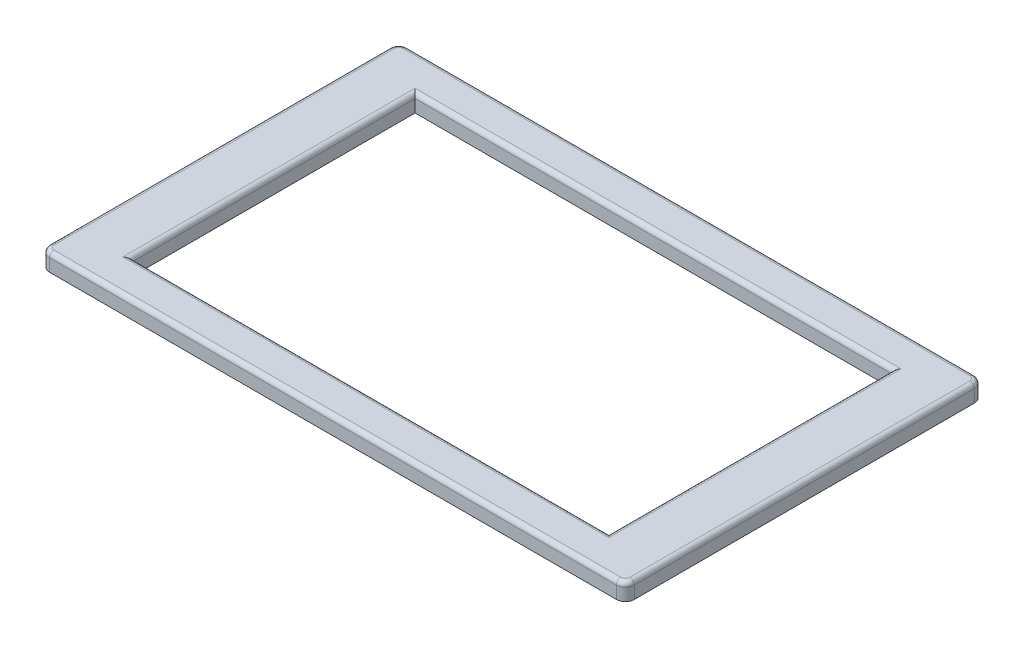
ISO-10303-21;
HEADER;
FILE_DESCRIPTION(('STEP AP214'),'2;1');
FILE_NAME('part.step','',(''),(''),'','','');
FILE_SCHEMA(('AUTOMOTIVE_DESIGN { 1 0 10303 214 1 1 1 1 }'));
ENDSEC;
DATA;
#1=APPLICATION_CONTEXT('core data for automotive mechanical design processes');
#2=APPLICATION_PROTOCOL_DEFINITION('international standard','automotive_design',2000,#1);
#3=PRODUCT_CONTEXT('',#1,'mechanical');
#4=PRODUCT('Part','Part','',(#3));
#5=PRODUCT_RELATED_PRODUCT_CATEGORY('part','',(#4));
#6=PRODUCT_DEFINITION_FORMATION('','',#4);
#7=PRODUCT_DEFINITION_CONTEXT('part definition',#1,'design');
#8=PRODUCT_DEFINITION('design','',#6,#7);
#9=PRODUCT_DEFINITION_SHAPE('','',#8);
#10=(LENGTH_UNIT() NAMED_UNIT(*) SI_UNIT(.MILLI.,.METRE.));
#11=(NAMED_UNIT(*) PLANE_ANGLE_UNIT() SI_UNIT($,.RADIAN.));
#12=(NAMED_UNIT(*) SI_UNIT($,.STERADIAN.) SOLID_ANGLE_UNIT());
#13=UNCERTAINTY_MEASURE_WITH_UNIT(LENGTH_MEASURE(1.E-05),#10,'distance_accuracy_value','');
#14=(GEOMETRIC_REPRESENTATION_CONTEXT(3) GLOBAL_UNCERTAINTY_ASSIGNED_CONTEXT((#13)) GLOBAL_UNIT_ASSIGNED_CONTEXT((#10,
#11,#12)) REPRESENTATION_CONTEXT('',''));
#15=CARTESIAN_POINT('',(0.,0.,0.));
#16=DIRECTION('',(0.,0.,1.));
#17=DIRECTION('',(1.,0.,0.));
#18=AXIS2_PLACEMENT_3D('',#15,#16,#17);
#19=CARTESIAN_POINT('',(4.00000000001397,5.7,-117.));
#20=DIRECTION('',(0.,-1.,0.));
#21=DIRECTION('',(0.,0.,-1.));
#22=AXIS2_PLACEMENT_3D('',#19,#20,#21);
#23=PLANE('',#22);
#24=DIRECTION('',(1.,0.,0.));
#25=VECTOR('',#24,1.);
#26=CARTESIAN_POINT('',(19.000000000014,5.7,-11.));
#27=LINE('',#26,#25);
#28=CARTESIAN_POINT('',(180.500000000014,5.7,-11.));
#29=VERTEX_POINT('',#28);
#30=CARTESIAN_POINT('',(17.500000000014,5.7,-11.));
#31=VERTEX_POINT('',#30);
#32=EDGE_CURVE('E266',#29,#31,#27,.F.);
#33=ORIENTED_EDGE('',*,*,#32,.T.);
#34=DIRECTION('',(0.,0.,1.));
#35=VECTOR('',#34,1.);
#36=CARTESIAN_POINT('',(17.500000000014,5.7,-107.5));
#37=LINE('',#36,#35);
#38=CARTESIAN_POINT('',(17.500000000014,5.7,-109.));
#39=VERTEX_POINT('',#38);
#40=EDGE_CURVE('E268',#31,#39,#37,.F.);
#41=ORIENTED_EDGE('',*,*,#40,.T.);
#42=DIRECTION('',(-1.,0.,0.));
#43=VECTOR('',#42,1.);
#44=CARTESIAN_POINT('',(179.000000000014,5.7,-109.));
#45=LINE('',#44,#43);
#46=CARTESIAN_POINT('',(180.500000000014,5.7,-109.));
#47=VERTEX_POINT('',#46);
#48=EDGE_CURVE('E262',#39,#47,#45,.F.);
#49=ORIENTED_EDGE('',*,*,#48,.T.);
#50=DIRECTION('',(0.,0.,-1.));
#51=VECTOR('',#50,1.);
#52=CARTESIAN_POINT('',(180.500000000014,5.7,-12.5));
#53=LINE('',#52,#51);
#54=EDGE_CURVE('E264',#47,#29,#53,.F.);
#55=ORIENTED_EDGE('',*,*,#54,.T.);
#56=EDGE_LOOP('',(#33,#41,#49,#55));
#57=FACE_BOUND('',#56,.T.);
#58=CARTESIAN_POINT('',(194.000000000014,5.7,-117.));
#59=DIRECTION('',(0.,-1.,0.));
#60=DIRECTION('',(0.,0.,-1.));
#61=AXIS2_PLACEMENT_3D('',#58,#59,#60);
#62=CIRCLE('',#61,1.49999999999998);
#63=CARTESIAN_POINT('',(195.500000000014,5.7,-117.));
#64=VERTEX_POINT('',#63);
#65=CARTESIAN_POINT('',(194.000000000014,5.7,-118.5));
#66=VERTEX_POINT('',#65);
#67=EDGE_CURVE('E257',#64,#66,#62,.F.);
#68=ORIENTED_EDGE('',*,*,#67,.T.);
#69=DIRECTION('',(-1.,0.,0.));
#70=VECTOR('',#69,1.);
#71=CARTESIAN_POINT('',(4.00000000001397,5.7,-118.5));
#72=LINE('',#71,#70);
#73=CARTESIAN_POINT('',(4.00000000001397,5.7,-118.5));
#74=VERTEX_POINT('',#73);
#75=EDGE_CURVE('E259',#66,#74,#72,.T.);
#76=ORIENTED_EDGE('',*,*,#75,.T.);
#77=CARTESIAN_POINT('',(4.00000000001397,5.7,-117.));
#78=DIRECTION('',(0.,-1.,0.));
#79=DIRECTION('',(0.,0.,-1.));
#80=AXIS2_PLACEMENT_3D('',#77,#78,#79);
#81=CIRCLE('',#80,1.5);
#82=CARTESIAN_POINT('',(2.50000000001397,5.7,-117.));
#83=VERTEX_POINT('',#82);
#84=EDGE_CURVE('E245',#74,#83,#81,.F.);
#85=ORIENTED_EDGE('',*,*,#84,.T.);
#86=DIRECTION('',(0.,0.,1.));
#87=VECTOR('',#86,1.);
#88=CARTESIAN_POINT('',(2.50000000001397,5.7,-117.));
#89=LINE('',#88,#87);
#90=CARTESIAN_POINT('',(2.50000000001397,5.7,-2.99999999999999));
#91=VERTEX_POINT('',#90);
#92=EDGE_CURVE('E247',#83,#91,#89,.T.);
#93=ORIENTED_EDGE('',*,*,#92,.T.);
#94=CARTESIAN_POINT('',(4.00000000001397,5.7,-2.99999999999998));
#95=DIRECTION('',(0.,-1.,0.));
#96=DIRECTION('',(0.,0.,-1.));
#97=AXIS2_PLACEMENT_3D('',#94,#95,#96);
#98=CIRCLE('',#97,1.5);
#99=CARTESIAN_POINT('',(4.00000000001395,5.7,-1.49999999999998));
#100=VERTEX_POINT('',#99);
#101=EDGE_CURVE('E249',#91,#100,#98,.F.);
#102=ORIENTED_EDGE('',*,*,#101,.T.);
#103=DIRECTION('',(1.,0.,0.));
#104=VECTOR('',#103,1.);
#105=CARTESIAN_POINT('',(4.00000000001397,5.7,-1.49999999999999));
#106=LINE('',#105,#104);
#107=CARTESIAN_POINT('',(194.000000000014,5.7,-1.49999999999999));
#108=VERTEX_POINT('',#107);
#109=EDGE_CURVE('E251',#100,#108,#106,.T.);
#110=ORIENTED_EDGE('',*,*,#109,.T.);
#111=CARTESIAN_POINT('',(194.000000000014,5.7,-2.99999999999998));
#112=DIRECTION('',(0.,-1.,0.));
#113=DIRECTION('',(0.,0.,-1.));
#114=AXIS2_PLACEMENT_3D('',#111,#112,#113);
#115=CIRCLE('',#114,1.5);
#116=CARTESIAN_POINT('',(195.500000000014,5.7,-2.99999999999998));
#117=VERTEX_POINT('',#116);
#118=EDGE_CURVE('E253',#108,#117,#115,.F.);
#119=ORIENTED_EDGE('',*,*,#118,.T.);
#120=DIRECTION('',(0.,0.,-1.));
#121=VECTOR('',#120,1.);
#122=CARTESIAN_POINT('',(195.500000000014,5.7,-117.));
#123=LINE('',#122,#121);
#124=EDGE_CURVE('E255',#117,#64,#123,.T.);
#125=ORIENTED_EDGE('',*,*,#124,.T.);
#126=EDGE_LOOP('',(#68,#76,#85,#93,#102,#110,#119,#125));
#127=FACE_BOUND('',#126,.T.);
#128=ADVANCED_FACE('F35',(#57,#127),#23,.F.);
#129=CARTESIAN_POINT('',(4.00000000001397,0.,-117.));
#130=DIRECTION('',(0.,-1.,0.));
#131=DIRECTION('',(0.,0.,-1.));
#132=AXIS2_PLACEMENT_3D('',#129,#130,#131);
#133=PLANE('',#132);
#134=CARTESIAN_POINT('',(193.000000000014,0.,-87.387683659692));
#135=DIRECTION('',(0.,-1.,0.));
#136=DIRECTION('',(0.,0.,-1.));
#137=AXIS2_PLACEMENT_3D('',#134,#135,#136);
#138=CIRCLE('',#137,2.);
#139=CARTESIAN_POINT('',(193.000000000014,0.,-89.387683659692));
#140=VERTEX_POINT('',#139);
#141=EDGE_CURVE('E490',#140,#140,#138,.T.);
#142=ORIENTED_EDGE('',*,*,#141,.F.);
#143=EDGE_LOOP('',(#142));
#144=FACE_BOUND('',#143,.T.);
#145=CARTESIAN_POINT('',(193.000000000014,0.,-27.387683659692));
#146=DIRECTION('',(0.,-1.,0.));
#147=DIRECTION('',(0.,0.,-1.));
#148=AXIS2_PLACEMENT_3D('',#145,#146,#147);
#149=CIRCLE('',#148,2.);
#150=CARTESIAN_POINT('',(193.000000000014,0.,-29.387683659692));
#151=VERTEX_POINT('',#150);
#152=EDGE_CURVE('E489',#151,#151,#149,.T.);
#153=ORIENTED_EDGE('',*,*,#152,.F.);
#154=EDGE_LOOP('',(#153));
#155=FACE_BOUND('',#154,.T.);
#156=CARTESIAN_POINT('',(5.00000000001397,0.,-87.387683659692));
#157=DIRECTION('',(0.,-1.,0.));
#158=DIRECTION('',(0.,0.,-1.));
#159=AXIS2_PLACEMENT_3D('',#156,#157,#158);
#160=CIRCLE('',#159,2.);
#161=CARTESIAN_POINT('',(5.00000000001397,0.,-89.387683659692));
#162=VERTEX_POINT('',#161);
#163=EDGE_CURVE('E499',#162,#162,#160,.T.);
#164=ORIENTED_EDGE('',*,*,#163,.F.);
#165=EDGE_LOOP('',(#164));
#166=FACE_BOUND('',#165,.T.);
#167=CARTESIAN_POINT('',(5.00000000001397,0.,-27.387683659692));
#168=DIRECTION('',(0.,-1.,0.));
#169=DIRECTION('',(0.,0.,-1.));
#170=AXIS2_PLACEMENT_3D('',#167,#168,#169);
#171=CIRCLE('',#170,2.);
#172=CARTESIAN_POINT('',(5.00000000001397,0.,-29.387683659692));
#173=VERTEX_POINT('',#172);
#174=EDGE_CURVE('E194',#173,#173,#171,.T.);
#175=ORIENTED_EDGE('',*,*,#174,.F.);
#176=EDGE_LOOP('',(#175));
#177=FACE_BOUND('',#176,.T.);
#178=CARTESIAN_POINT('',(4.00000000001397,0.,-117.));
#179=DIRECTION('',(0.,1.,0.));
#180=DIRECTION('',(0.,0.,-1.));
#181=AXIS2_PLACEMENT_3D('',#178,#179,#180);
#182=CIRCLE('',#181,3.);
#183=CARTESIAN_POINT('',(4.00000000001397,0.,-120.));
#184=VERTEX_POINT('',#183);
#185=CARTESIAN_POINT('',(1.00000000001397,0.,-117.));
#186=VERTEX_POINT('',#185);
#187=EDGE_CURVE('E173',#184,#186,#182,.T.);
#188=ORIENTED_EDGE('',*,*,#187,.F.);
#189=DIRECTION('',(-1.,0.,0.));
#190=VECTOR('',#189,1.);
#191=CARTESIAN_POINT('',(4.00000000001397,0.,-120.));
#192=LINE('',#191,#190);
#193=CARTESIAN_POINT('',(194.000000000014,0.,-120.));
#194=VERTEX_POINT('',#193);
#195=EDGE_CURVE('E224',#194,#184,#192,.T.);
#196=ORIENTED_EDGE('',*,*,#195,.F.);
#197=CARTESIAN_POINT('',(194.000000000014,0.,-117.));
#198=DIRECTION('',(0.,1.,0.));
#199=DIRECTION('',(0.,0.,1.));
#200=AXIS2_PLACEMENT_3D('',#197,#198,#199);
#201=CIRCLE('',#200,2.99999999999998);
#202=CARTESIAN_POINT('',(197.000000000014,0.,-117.));
#203=VERTEX_POINT('',#202);
#204=EDGE_CURVE('E221',#203,#194,#201,.T.);
#205=ORIENTED_EDGE('',*,*,#204,.F.);
#206=DIRECTION('',(0.,0.,-1.));
#207=VECTOR('',#206,1.);
#208=CARTESIAN_POINT('',(197.000000000014,0.,-2.99999999999998));
#209=LINE('',#208,#207);
#210=CARTESIAN_POINT('',(197.000000000014,0.,-2.99999999999998));
#211=VERTEX_POINT('',#210);
#212=EDGE_CURVE('E218',#211,#203,#209,.T.);
#213=ORIENTED_EDGE('',*,*,#212,.F.);
#214=CARTESIAN_POINT('',(194.000000000014,0.,-2.99999999999998));
#215=DIRECTION('',(0.,1.,0.));
#216=DIRECTION('',(0.,0.,-1.));
#217=AXIS2_PLACEMENT_3D('',#214,#215,#216);
#218=CIRCLE('',#217,3.);
#219=CARTESIAN_POINT('',(194.000000000014,0.,0.));
#220=VERTEX_POINT('',#219);
#221=EDGE_CURVE('E215',#220,#211,#218,.T.);
#222=ORIENTED_EDGE('',*,*,#221,.F.);
#223=DIRECTION('',(1.,0.,0.));
#224=VECTOR('',#223,1.);
#225=CARTESIAN_POINT('',(194.000000000014,0.,0.));
#226=LINE('',#225,#224);
#227=CARTESIAN_POINT('',(4.00000000001395,0.,0.));
#228=VERTEX_POINT('',#227);
#229=EDGE_CURVE('E212',#228,#220,#226,.T.);
#230=ORIENTED_EDGE('',*,*,#229,.F.);
#231=CARTESIAN_POINT('',(4.00000000001397,0.,-2.99999999999998));
#232=DIRECTION('',(0.,1.,0.));
#233=DIRECTION('',(0.,0.,1.));
#234=AXIS2_PLACEMENT_3D('',#231,#232,#233);
#235=CIRCLE('',#234,3.);
#236=CARTESIAN_POINT('',(1.00000000001397,0.,-3.));
#237=VERTEX_POINT('',#236);
#238=EDGE_CURVE('E209',#237,#228,#235,.T.);
#239=ORIENTED_EDGE('',*,*,#238,.F.);
#240=DIRECTION('',(0.,0.,1.));
#241=VECTOR('',#240,1.);
#242=CARTESIAN_POINT('',(1.00000000001397,0.,-3.));
#243=LINE('',#242,#241);
#244=EDGE_CURVE('E206',#186,#237,#243,.T.);
#245=ORIENTED_EDGE('',*,*,#244,.F.);
#246=EDGE_LOOP('',(#188,#196,#205,#213,#222,#230,#239,#245));
#247=FACE_BOUND('',#246,.T.);
#248=DIRECTION('',(0.,0.,-1.));
#249=VECTOR('',#248,1.);
#250=CARTESIAN_POINT('',(179.000000000014,0.,-107.5));
#251=LINE('',#250,#249);
#252=CARTESIAN_POINT('',(179.000000000014,0.,-12.5));
#253=VERTEX_POINT('',#252);
#254=CARTESIAN_POINT('',(179.000000000014,0.,-107.5));
#255=VERTEX_POINT('',#254);
#256=EDGE_CURVE('E187',#253,#255,#251,.T.);
#257=ORIENTED_EDGE('',*,*,#256,.T.);
#258=DIRECTION('',(-1.,0.,0.));
#259=VECTOR('',#258,1.);
#260=CARTESIAN_POINT('',(19.000000000014,0.,-107.5));
#261=LINE('',#260,#259);
#262=CARTESIAN_POINT('',(19.000000000014,0.,-107.5));
#263=VERTEX_POINT('',#262);
#264=EDGE_CURVE('E166',#255,#263,#261,.T.);
#265=ORIENTED_EDGE('',*,*,#264,.T.);
#266=DIRECTION('',(0.,0.,1.));
#267=VECTOR('',#266,1.);
#268=CARTESIAN_POINT('',(19.000000000014,0.,-12.5));
#269=LINE('',#268,#267);
#270=CARTESIAN_POINT('',(19.000000000014,0.,-12.5));
#271=VERTEX_POINT('',#270);
#272=EDGE_CURVE('E177',#263,#271,#269,.T.);
#273=ORIENTED_EDGE('',*,*,#272,.T.);
#274=DIRECTION('',(1.,0.,0.));
#275=VECTOR('',#274,1.);
#276=CARTESIAN_POINT('',(179.000000000014,0.,-12.5));
#277=LINE('',#276,#275);
#278=EDGE_CURVE('E183',#271,#253,#277,.T.);
#279=ORIENTED_EDGE('',*,*,#278,.T.);
#280=EDGE_LOOP('',(#257,#265,#273,#279));
#281=FACE_BOUND('',#280,.T.);
#282=ADVANCED_FACE('F185',(#144,#155,#166,#177,#247,#281),#133,.T.);
#283=CARTESIAN_POINT('',(4.00000000001397,5.7,-117.));
#284=DIRECTION('',(0.,-1.,0.));
#285=DIRECTION('',(0.,0.,-1.));
#286=AXIS2_PLACEMENT_3D('',#283,#284,#285);
#287=CYLINDRICAL_SURFACE('',#286,3.);
#288=DIRECTION('',(0.,-1.,0.));
#289=VECTOR('',#288,1.);
#290=CARTESIAN_POINT('',(1.00000000001397,5.7,-117.));
#291=LINE('',#290,#289);
#292=CARTESIAN_POINT('',(1.00000000001397,4.2,-117.));
#293=VERTEX_POINT('',#292);
#294=EDGE_CURVE('E241',#293,#186,#291,.T.);
#295=ORIENTED_EDGE('',*,*,#294,.F.);
#296=CARTESIAN_POINT('',(4.00000000001397,4.2,-117.));
#297=DIRECTION('',(0.,-1.,0.));
#298=DIRECTION('',(0.,0.,-1.));
#299=AXIS2_PLACEMENT_3D('',#296,#297,#298);
#300=CIRCLE('',#299,3.);
#301=CARTESIAN_POINT('',(4.00000000001397,4.2,-120.));
#302=VERTEX_POINT('',#301);
#303=EDGE_CURVE('E11',#293,#302,#300,.T.);
#304=ORIENTED_EDGE('',*,*,#303,.T.);
#305=DIRECTION('',(0.,-1.,0.));
#306=VECTOR('',#305,1.);
#307=CARTESIAN_POINT('',(4.00000000001397,5.7,-120.));
#308=LINE('',#307,#306);
#309=EDGE_CURVE('E227',#302,#184,#308,.T.);
#310=ORIENTED_EDGE('',*,*,#309,.T.);
#311=ORIENTED_EDGE('',*,*,#187,.T.);
#312=EDGE_LOOP('',(#295,#304,#310,#311));
#313=FACE_BOUND('',#312,.T.);
#314=ADVANCED_FACE('F369',(#313),#287,.T.);
#315=CARTESIAN_POINT('',(1.00000000001397,5.7,-3.));
#316=DIRECTION('',(1.,0.,0.));
#317=DIRECTION('',(0.,0.,-1.));
#318=AXIS2_PLACEMENT_3D('',#315,#316,#317);
#319=PLANE('',#318);
#320=DIRECTION('',(0.,-1.,0.));
#321=VECTOR('',#320,1.);
#322=CARTESIAN_POINT('',(1.00000000001397,5.7,-3.));
#323=LINE('',#322,#321);
#324=CARTESIAN_POINT('',(1.00000000001397,4.2,-3.));
#325=VERTEX_POINT('',#324);
#326=EDGE_CURVE('E239',#325,#237,#323,.T.);
#327=ORIENTED_EDGE('',*,*,#326,.F.);
#328=DIRECTION('',(0.,0.,1.));
#329=VECTOR('',#328,1.);
#330=CARTESIAN_POINT('',(1.00000000001397,4.2,-3.));
#331=LINE('',#330,#329);
#332=EDGE_CURVE('E44',#325,#293,#331,.F.);
#333=ORIENTED_EDGE('',*,*,#332,.T.);
#334=ORIENTED_EDGE('',*,*,#294,.T.);
#335=ORIENTED_EDGE('',*,*,#244,.T.);
#336=EDGE_LOOP('',(#327,#333,#334,#335));
#337=FACE_BOUND('',#336,.T.);
#338=ADVANCED_FACE('F414',(#337),#319,.F.);
#339=CARTESIAN_POINT('',(4.00000000001397,5.7,-2.99999999999998));
#340=DIRECTION('',(0.,-1.,0.));
#341=DIRECTION('',(0.,0.,-1.));
#342=AXIS2_PLACEMENT_3D('',#339,#340,#341);
#343=CYLINDRICAL_SURFACE('',#342,3.);
#344=DIRECTION('',(0.,-1.,0.));
#345=VECTOR('',#344,1.);
#346=CARTESIAN_POINT('',(4.00000000001395,5.7,0.));
#347=LINE('',#346,#345);
#348=CARTESIAN_POINT('',(4.00000000001395,4.2,0.));
#349=VERTEX_POINT('',#348);
#350=EDGE_CURVE('E237',#349,#228,#347,.T.);
#351=ORIENTED_EDGE('',*,*,#350,.F.);
#352=CARTESIAN_POINT('',(4.00000000001397,4.2,-2.99999999999998));
#353=DIRECTION('',(0.,-1.,0.));
#354=DIRECTION('',(0.,0.,-1.));
#355=AXIS2_PLACEMENT_3D('',#352,#353,#354);
#356=CIRCLE('',#355,3.);
#357=EDGE_CURVE('E59',#349,#325,#356,.T.);
#358=ORIENTED_EDGE('',*,*,#357,.T.);
#359=ORIENTED_EDGE('',*,*,#326,.T.);
#360=ORIENTED_EDGE('',*,*,#238,.T.);
#361=EDGE_LOOP('',(#351,#358,#359,#360));
#362=FACE_BOUND('',#361,.T.);
#363=ADVANCED_FACE('F329',(#362),#343,.T.);
#364=CARTESIAN_POINT('',(194.000000000014,5.7,0.));
#365=DIRECTION('',(0.,0.,-1.));
#366=DIRECTION('',(-1.,0.,0.));
#367=AXIS2_PLACEMENT_3D('',#364,#365,#366);
#368=PLANE('',#367);
#369=DIRECTION('',(0.,-1.,0.));
#370=VECTOR('',#369,1.);
#371=CARTESIAN_POINT('',(194.000000000014,5.7,0.));
#372=LINE('',#371,#370);
#373=CARTESIAN_POINT('',(194.000000000014,4.2,0.));
#374=VERTEX_POINT('',#373);
#375=EDGE_CURVE('E235',#374,#220,#372,.T.);
#376=ORIENTED_EDGE('',*,*,#375,.F.);
#377=DIRECTION('',(1.,0.,0.));
#378=VECTOR('',#377,1.);
#379=CARTESIAN_POINT('',(194.000000000014,4.2,0.));
#380=LINE('',#379,#378);
#381=EDGE_CURVE('E285',#374,#349,#380,.F.);
#382=ORIENTED_EDGE('',*,*,#381,.T.);
#383=ORIENTED_EDGE('',*,*,#350,.T.);
#384=ORIENTED_EDGE('',*,*,#229,.T.);
#385=EDGE_LOOP('',(#376,#382,#383,#384));
#386=FACE_BOUND('',#385,.T.);
#387=ADVANCED_FACE('F328',(#386),#368,.F.);
#388=CARTESIAN_POINT('',(194.000000000014,5.7,-2.99999999999998));
#389=DIRECTION('',(0.,-1.,0.));
#390=DIRECTION('',(0.,0.,-1.));
#391=AXIS2_PLACEMENT_3D('',#388,#389,#390);
#392=CYLINDRICAL_SURFACE('',#391,3.);
#393=DIRECTION('',(0.,-1.,0.));
#394=VECTOR('',#393,1.);
#395=CARTESIAN_POINT('',(197.000000000014,5.7,-2.99999999999998));
#396=LINE('',#395,#394);
#397=CARTESIAN_POINT('',(197.000000000014,4.2,-2.99999999999998));
#398=VERTEX_POINT('',#397);
#399=EDGE_CURVE('E233',#398,#211,#396,.T.);
#400=ORIENTED_EDGE('',*,*,#399,.F.);
#401=CARTESIAN_POINT('',(194.000000000014,4.2,-2.99999999999998));
#402=DIRECTION('',(0.,-1.,0.));
#403=DIRECTION('',(0.,0.,-1.));
#404=AXIS2_PLACEMENT_3D('',#401,#402,#403);
#405=CIRCLE('',#404,3.);
#406=EDGE_CURVE('E283',#398,#374,#405,.T.);
#407=ORIENTED_EDGE('',*,*,#406,.T.);
#408=ORIENTED_EDGE('',*,*,#375,.T.);
#409=ORIENTED_EDGE('',*,*,#221,.T.);
#410=EDGE_LOOP('',(#400,#407,#408,#409));
#411=FACE_BOUND('',#410,.T.);
#412=ADVANCED_FACE('F340',(#411),#392,.T.);
#413=CARTESIAN_POINT('',(197.000000000014,5.7,-2.99999999999998));
#414=DIRECTION('',(-1.,0.,0.));
#415=DIRECTION('',(0.,0.,1.));
#416=AXIS2_PLACEMENT_3D('',#413,#414,#415);
#417=PLANE('',#416);
#418=DIRECTION('',(0.,-1.,0.));
#419=VECTOR('',#418,1.);
#420=CARTESIAN_POINT('',(197.000000000014,5.7,-117.));
#421=LINE('',#420,#419);
#422=CARTESIAN_POINT('',(197.000000000014,4.2,-117.));
#423=VERTEX_POINT('',#422);
#424=EDGE_CURVE('E231',#423,#203,#421,.T.);
#425=ORIENTED_EDGE('',*,*,#424,.F.);
#426=DIRECTION('',(0.,0.,-1.));
#427=VECTOR('',#426,1.);
#428=CARTESIAN_POINT('',(197.000000000014,4.2,-2.99999999999998));
#429=LINE('',#428,#427);
#430=EDGE_CURVE('E281',#423,#398,#429,.F.);
#431=ORIENTED_EDGE('',*,*,#430,.T.);
#432=ORIENTED_EDGE('',*,*,#399,.T.);
#433=ORIENTED_EDGE('',*,*,#212,.T.);
#434=EDGE_LOOP('',(#425,#431,#432,#433));
#435=FACE_BOUND('',#434,.T.);
#436=ADVANCED_FACE('F343',(#435),#417,.F.);
#437=CARTESIAN_POINT('',(194.000000000014,5.7,-117.));
#438=DIRECTION('',(0.,-1.,0.));
#439=DIRECTION('',(0.,0.,-1.));
#440=AXIS2_PLACEMENT_3D('',#437,#438,#439);
#441=CYLINDRICAL_SURFACE('',#440,2.99999999999998);
#442=DIRECTION('',(0.,-1.,0.));
#443=VECTOR('',#442,1.);
#444=CARTESIAN_POINT('',(194.000000000014,5.7,-120.));
#445=LINE('',#444,#443);
#446=CARTESIAN_POINT('',(194.000000000014,4.2,-120.));
#447=VERTEX_POINT('',#446);
#448=EDGE_CURVE('E229',#447,#194,#445,.T.);
#449=ORIENTED_EDGE('',*,*,#448,.F.);
#450=CARTESIAN_POINT('',(194.000000000014,4.2,-117.));
#451=DIRECTION('',(0.,-1.,0.));
#452=DIRECTION('',(0.,0.,-1.));
#453=AXIS2_PLACEMENT_3D('',#450,#451,#452);
#454=CIRCLE('',#453,2.99999999999998);
#455=EDGE_CURVE('E279',#447,#423,#454,.T.);
#456=ORIENTED_EDGE('',*,*,#455,.T.);
#457=ORIENTED_EDGE('',*,*,#424,.T.);
#458=ORIENTED_EDGE('',*,*,#204,.T.);
#459=EDGE_LOOP('',(#449,#456,#457,#458));
#460=FACE_BOUND('',#459,.T.);
#461=ADVANCED_FACE('F402',(#460),#441,.T.);
#462=CARTESIAN_POINT('',(4.00000000001397,5.7,-120.));
#463=DIRECTION('',(0.,0.,1.));
#464=DIRECTION('',(1.,0.,0.));
#465=AXIS2_PLACEMENT_3D('',#462,#463,#464);
#466=PLANE('',#465);
#467=ORIENTED_EDGE('',*,*,#309,.F.);
#468=DIRECTION('',(-1.,0.,0.));
#469=VECTOR('',#468,1.);
#470=CARTESIAN_POINT('',(4.00000000001397,4.2,-120.));
#471=LINE('',#470,#469);
#472=EDGE_CURVE('E276',#302,#447,#471,.F.);
#473=ORIENTED_EDGE('',*,*,#472,.T.);
#474=ORIENTED_EDGE('',*,*,#448,.T.);
#475=ORIENTED_EDGE('',*,*,#195,.T.);
#476=EDGE_LOOP('',(#467,#473,#474,#475));
#477=FACE_BOUND('',#476,.T.);
#478=ADVANCED_FACE('F372',(#477),#466,.F.);
#479=CARTESIAN_POINT('',(19.000000000014,5.7,-107.5));
#480=DIRECTION('',(0.,0.,1.));
#481=DIRECTION('',(1.,0.,0.));
#482=AXIS2_PLACEMENT_3D('',#479,#480,#481);
#483=PLANE('',#482);
#484=DIRECTION('',(0.,-1.,0.));
#485=VECTOR('',#484,1.);
#486=CARTESIAN_POINT('',(179.000000000014,5.7,-107.5));
#487=LINE('',#486,#485);
#488=CARTESIAN_POINT('',(179.000000000014,4.2,-107.5));
#489=VERTEX_POINT('',#488);
#490=EDGE_CURVE('E199',#489,#255,#487,.T.);
#491=ORIENTED_EDGE('',*,*,#490,.F.);
#492=DIRECTION('',(-1.,0.,0.));
#493=VECTOR('',#492,1.);
#494=CARTESIAN_POINT('',(19.000000000014,4.2,-107.5));
#495=LINE('',#494,#493);
#496=CARTESIAN_POINT('',(19.000000000014,4.2,-107.5));
#497=VERTEX_POINT('',#496);
#498=EDGE_CURVE('E169',#489,#497,#495,.T.);
#499=ORIENTED_EDGE('',*,*,#498,.T.);
#500=DIRECTION('',(0.,-1.,0.));
#501=VECTOR('',#500,1.);
#502=CARTESIAN_POINT('',(19.000000000014,5.7,-107.5));
#503=LINE('',#502,#501);
#504=EDGE_CURVE('E161',#497,#263,#503,.T.);
#505=ORIENTED_EDGE('',*,*,#504,.T.);
#506=ORIENTED_EDGE('',*,*,#264,.F.);
#507=EDGE_LOOP('',(#491,#499,#505,#506));
#508=FACE_BOUND('',#507,.T.);
#509=ADVANCED_FACE('F164',(#508),#483,.T.);
#510=CARTESIAN_POINT('',(19.000000000014,5.7,-12.5));
#511=DIRECTION('',(1.,0.,0.));
#512=DIRECTION('',(0.,0.,-1.));
#513=AXIS2_PLACEMENT_3D('',#510,#511,#512);
#514=PLANE('',#513);
#515=ORIENTED_EDGE('',*,*,#504,.F.);
#516=DIRECTION('',(0.,0.,1.));
#517=VECTOR('',#516,1.);
#518=CARTESIAN_POINT('',(19.000000000014,4.2,-12.5));
#519=LINE('',#518,#517);
#520=CARTESIAN_POINT('',(19.000000000014,4.2,-12.5));
#521=VERTEX_POINT('',#520);
#522=EDGE_CURVE('E243',#497,#521,#519,.T.);
#523=ORIENTED_EDGE('',*,*,#522,.T.);
#524=DIRECTION('',(0.,-1.,0.));
#525=VECTOR('',#524,1.);
#526=CARTESIAN_POINT('',(19.000000000014,5.7,-12.5));
#527=LINE('',#526,#525);
#528=EDGE_CURVE('E174',#521,#271,#527,.T.);
#529=ORIENTED_EDGE('',*,*,#528,.T.);
#530=ORIENTED_EDGE('',*,*,#272,.F.);
#531=EDGE_LOOP('',(#515,#523,#529,#530));
#532=FACE_BOUND('',#531,.T.);
#533=ADVANCED_FACE('F178',(#532),#514,.T.);
#534=CARTESIAN_POINT('',(179.000000000014,5.7,-12.5));
#535=DIRECTION('',(0.,0.,-1.));
#536=DIRECTION('',(-1.,0.,0.));
#537=AXIS2_PLACEMENT_3D('',#534,#535,#536);
#538=PLANE('',#537);
#539=ORIENTED_EDGE('',*,*,#528,.F.);
#540=DIRECTION('',(1.,0.,0.));
#541=VECTOR('',#540,1.);
#542=CARTESIAN_POINT('',(179.000000000014,4.2,-12.5));
#543=LINE('',#542,#541);
#544=CARTESIAN_POINT('',(179.000000000014,4.2,-12.5));
#545=VERTEX_POINT('',#544);
#546=EDGE_CURVE('E271',#521,#545,#543,.T.);
#547=ORIENTED_EDGE('',*,*,#546,.T.);
#548=DIRECTION('',(0.,-1.,0.));
#549=VECTOR('',#548,1.);
#550=CARTESIAN_POINT('',(179.000000000014,5.7,-12.5));
#551=LINE('',#550,#549);
#552=EDGE_CURVE('E201',#545,#253,#551,.T.);
#553=ORIENTED_EDGE('',*,*,#552,.T.);
#554=ORIENTED_EDGE('',*,*,#278,.F.);
#555=EDGE_LOOP('',(#539,#547,#553,#554));
#556=FACE_BOUND('',#555,.T.);
#557=ADVANCED_FACE('F437',(#556),#538,.T.);
#558=CARTESIAN_POINT('',(179.000000000014,5.7,-107.5));
#559=DIRECTION('',(-1.,0.,0.));
#560=DIRECTION('',(0.,0.,1.));
#561=AXIS2_PLACEMENT_3D('',#558,#559,#560);
#562=PLANE('',#561);
#563=ORIENTED_EDGE('',*,*,#552,.F.);
#564=DIRECTION('',(0.,0.,-1.));
#565=VECTOR('',#564,1.);
#566=CARTESIAN_POINT('',(179.000000000014,4.2,-107.5));
#567=LINE('',#566,#565);
#568=EDGE_CURVE('E273',#545,#489,#567,.T.);
#569=ORIENTED_EDGE('',*,*,#568,.T.);
#570=ORIENTED_EDGE('',*,*,#490,.T.);
#571=ORIENTED_EDGE('',*,*,#256,.F.);
#572=EDGE_LOOP('',(#563,#569,#570,#571));
#573=FACE_BOUND('',#572,.T.);
#574=ADVANCED_FACE('F432',(#573),#562,.T.);
#575=CARTESIAN_POINT('',(180.500000000014,4.2,-107.5));
#576=DIRECTION('',(0.,0.,1.));
#577=DIRECTION('',(1.,0.,0.));
#578=AXIS2_PLACEMENT_3D('',#575,#576,#577);
#579=CYLINDRICAL_SURFACE('',#578,1.5);
#580=CARTESIAN_POINT('',(180.500000000014,4.2,-11.));
#581=DIRECTION('',(-0.707106781186547,0.,0.707106781186548));
#582=DIRECTION('',(-0.707106781186548,0.,-0.707106781186547));
#583=AXIS2_PLACEMENT_3D('',#580,#581,#582);
#584=ELLIPSE('',#583,2.12132034355964,1.5);
#585=EDGE_CURVE('E191',#29,#545,#584,.T.);
#586=ORIENTED_EDGE('',*,*,#585,.F.);
#587=ORIENTED_EDGE('',*,*,#54,.F.);
#588=CARTESIAN_POINT('',(180.500000000014,4.2,-109.));
#589=DIRECTION('',(0.707106781186547,0.,0.707106781186547));
#590=DIRECTION('',(-0.707106781186547,0.,0.707106781186547));
#591=AXIS2_PLACEMENT_3D('',#588,#589,#590);
#592=ELLIPSE('',#591,2.12132034355964,1.5);
#593=EDGE_CURVE('E188',#489,#47,#592,.F.);
#594=ORIENTED_EDGE('',*,*,#593,.F.);
#595=ORIENTED_EDGE('',*,*,#568,.F.);
#596=EDGE_LOOP('',(#586,#587,#594,#595));
#597=FACE_BOUND('',#596,.T.);
#598=ADVANCED_FACE('F429',(#597),#579,.T.);
#599=CARTESIAN_POINT('',(19.000000000014,4.2,-109.));
#600=DIRECTION('',(1.,0.,0.));
#601=DIRECTION('',(0.,0.,-1.));
#602=AXIS2_PLACEMENT_3D('',#599,#600,#601);
#603=CYLINDRICAL_SURFACE('',#602,1.5);
#604=ORIENTED_EDGE('',*,*,#593,.T.);
#605=ORIENTED_EDGE('',*,*,#48,.F.);
#606=CARTESIAN_POINT('',(17.500000000014,4.2,-109.));
#607=DIRECTION('',(0.707106781186547,0.,-0.707106781186547));
#608=DIRECTION('',(-0.707106781186547,0.,-0.707106781186547));
#609=AXIS2_PLACEMENT_3D('',#606,#607,#608);
#610=ELLIPSE('',#609,2.12132034355964,1.5);
#611=EDGE_CURVE('E291',#497,#39,#610,.F.);
#612=ORIENTED_EDGE('',*,*,#611,.F.);
#613=ORIENTED_EDGE('',*,*,#498,.F.);
#614=EDGE_LOOP('',(#604,#605,#612,#613));
#615=FACE_BOUND('',#614,.T.);
#616=ADVANCED_FACE('F426',(#615),#603,.T.);
#617=CARTESIAN_POINT('',(179.000000000014,4.2,-11.));
#618=DIRECTION('',(-1.,0.,0.));
#619=DIRECTION('',(0.,0.,1.));
#620=AXIS2_PLACEMENT_3D('',#617,#618,#619);
#621=CYLINDRICAL_SURFACE('',#620,1.5);
#622=ORIENTED_EDGE('',*,*,#585,.T.);
#623=ORIENTED_EDGE('',*,*,#546,.F.);
#624=CARTESIAN_POINT('',(17.500000000014,4.2,-11.));
#625=DIRECTION('',(-0.707106781186548,0.,-0.707106781186547));
#626=DIRECTION('',(0.707106781186547,0.,-0.707106781186548));
#627=AXIS2_PLACEMENT_3D('',#624,#625,#626);
#628=ELLIPSE('',#627,2.12132034355964,1.5);
#629=EDGE_CURVE('E289',#31,#521,#628,.T.);
#630=ORIENTED_EDGE('',*,*,#629,.F.);
#631=ORIENTED_EDGE('',*,*,#32,.F.);
#632=EDGE_LOOP('',(#622,#623,#630,#631));
#633=FACE_BOUND('',#632,.T.);
#634=ADVANCED_FACE('F422',(#633),#621,.T.);
#635=CARTESIAN_POINT('',(17.500000000014,4.2,-12.5));
#636=DIRECTION('',(0.,0.,-1.));
#637=DIRECTION('',(-1.,0.,0.));
#638=AXIS2_PLACEMENT_3D('',#635,#636,#637);
#639=CYLINDRICAL_SURFACE('',#638,1.5);
#640=ORIENTED_EDGE('',*,*,#611,.T.);
#641=ORIENTED_EDGE('',*,*,#40,.F.);
#642=ORIENTED_EDGE('',*,*,#629,.T.);
#643=ORIENTED_EDGE('',*,*,#522,.F.);
#644=EDGE_LOOP('',(#640,#641,#642,#643));
#645=FACE_BOUND('',#644,.T.);
#646=ADVANCED_FACE('F419',(#645),#639,.T.);
#647=CARTESIAN_POINT('',(4.00000000001397,4.2,-1.49999999999999));
#648=DIRECTION('',(1.,0.,0.));
#649=DIRECTION('',(0.,0.,-1.));
#650=AXIS2_PLACEMENT_3D('',#647,#648,#649);
#651=CYLINDRICAL_SURFACE('',#650,1.5);
#652=CARTESIAN_POINT('',(4.00000000001395,4.2,-1.49999999999998));
#653=DIRECTION('',(-1.,0.,0.));
#654=DIRECTION('',(0.,0.,1.));
#655=AXIS2_PLACEMENT_3D('',#652,#653,#654);
#656=CIRCLE('',#655,1.5);
#657=EDGE_CURVE('E311',#349,#100,#656,.T.);
#658=ORIENTED_EDGE('',*,*,#657,.F.);
#659=ORIENTED_EDGE('',*,*,#381,.F.);
#660=CARTESIAN_POINT('',(194.000000000014,4.2,-1.49999999999999));
#661=DIRECTION('',(1.,0.,0.));
#662=DIRECTION('',(0.,0.,-1.));
#663=AXIS2_PLACEMENT_3D('',#660,#661,#662);
#664=CIRCLE('',#663,1.5);
#665=EDGE_CURVE('E39',#108,#374,#664,.T.);
#666=ORIENTED_EDGE('',*,*,#665,.F.);
#667=ORIENTED_EDGE('',*,*,#109,.F.);
#668=EDGE_LOOP('',(#658,#659,#666,#667));
#669=FACE_BOUND('',#668,.T.);
#670=ADVANCED_FACE('F37',(#669),#651,.T.);
#671=CARTESIAN_POINT('',(194.000000000014,4.2,-2.99999999999998));
#672=DIRECTION('',(0.,-1.,0.));
#673=DIRECTION('',(0.,0.,-1.));
#674=AXIS2_PLACEMENT_3D('',#671,#672,#673);
#675=TOROIDAL_SURFACE('',#674,1.5,1.5);
#676=ORIENTED_EDGE('',*,*,#665,.T.);
#677=ORIENTED_EDGE('',*,*,#406,.F.);
#678=CARTESIAN_POINT('',(195.500000000014,4.2,-2.99999999999998));
#679=DIRECTION('',(0.,0.,-1.));
#680=DIRECTION('',(-1.,0.,0.));
#681=AXIS2_PLACEMENT_3D('',#678,#679,#680);
#682=CIRCLE('',#681,1.5);
#683=EDGE_CURVE('E309',#117,#398,#682,.T.);
#684=ORIENTED_EDGE('',*,*,#683,.F.);
#685=ORIENTED_EDGE('',*,*,#118,.F.);
#686=EDGE_LOOP('',(#676,#677,#684,#685));
#687=FACE_BOUND('',#686,.T.);
#688=ADVANCED_FACE('F321',(#687),#675,.T.);
#689=CARTESIAN_POINT('',(4.00000000001397,4.2,-2.99999999999998));
#690=DIRECTION('',(0.,-1.,0.));
#691=DIRECTION('',(0.,0.,-1.));
#692=AXIS2_PLACEMENT_3D('',#689,#690,#691);
#693=DEGENERATE_TOROIDAL_SURFACE('',#692,1.5,1.5,.T.);
#694=ORIENTED_EDGE('',*,*,#657,.T.);
#695=ORIENTED_EDGE('',*,*,#101,.F.);
#696=CARTESIAN_POINT('',(2.50000000001397,4.2,-2.99999999999999));
#697=DIRECTION('',(0.,0.,-1.));
#698=DIRECTION('',(-1.,0.,0.));
#699=AXIS2_PLACEMENT_3D('',#696,#697,#698);
#700=CIRCLE('',#699,1.5);
#701=EDGE_CURVE('E306',#325,#91,#700,.T.);
#702=ORIENTED_EDGE('',*,*,#701,.F.);
#703=ORIENTED_EDGE('',*,*,#357,.F.);
#704=EDGE_LOOP('',(#694,#695,#702,#703));
#705=FACE_BOUND('',#704,.T.);
#706=ADVANCED_FACE('F358',(#705),#693,.T.);
#707=CARTESIAN_POINT('',(195.500000000014,4.2,-117.));
#708=DIRECTION('',(0.,0.,-1.));
#709=DIRECTION('',(-1.,0.,0.));
#710=AXIS2_PLACEMENT_3D('',#707,#708,#709);
#711=CYLINDRICAL_SURFACE('',#710,1.5);
#712=ORIENTED_EDGE('',*,*,#683,.T.);
#713=ORIENTED_EDGE('',*,*,#430,.F.);
#714=CARTESIAN_POINT('',(195.500000000014,4.2,-117.));
#715=DIRECTION('',(0.,0.,-1.));
#716=DIRECTION('',(-1.,0.,0.));
#717=AXIS2_PLACEMENT_3D('',#714,#715,#716);
#718=CIRCLE('',#717,1.5);
#719=EDGE_CURVE('E303',#64,#423,#718,.T.);
#720=ORIENTED_EDGE('',*,*,#719,.F.);
#721=ORIENTED_EDGE('',*,*,#124,.F.);
#722=EDGE_LOOP('',(#712,#713,#720,#721));
#723=FACE_BOUND('',#722,.T.);
#724=ADVANCED_FACE('F347',(#723),#711,.T.);
#725=CARTESIAN_POINT('',(2.50000000001397,4.2,-117.));
#726=DIRECTION('',(0.,0.,1.));
#727=DIRECTION('',(1.,0.,0.));
#728=AXIS2_PLACEMENT_3D('',#725,#726,#727);
#729=CYLINDRICAL_SURFACE('',#728,1.5);
#730=ORIENTED_EDGE('',*,*,#701,.T.);
#731=ORIENTED_EDGE('',*,*,#92,.F.);
#732=CARTESIAN_POINT('',(2.50000000001397,4.2,-117.));
#733=DIRECTION('',(0.,0.,-1.));
#734=DIRECTION('',(-1.,0.,0.));
#735=AXIS2_PLACEMENT_3D('',#732,#733,#734);
#736=CIRCLE('',#735,1.5);
#737=EDGE_CURVE('E300',#293,#83,#736,.T.);
#738=ORIENTED_EDGE('',*,*,#737,.F.);
#739=ORIENTED_EDGE('',*,*,#332,.F.);
#740=EDGE_LOOP('',(#730,#731,#738,#739));
#741=FACE_BOUND('',#740,.T.);
#742=ADVANCED_FACE('F360',(#741),#729,.T.);
#743=CARTESIAN_POINT('',(194.000000000014,4.2,-117.));
#744=DIRECTION('',(0.,-1.,0.));
#745=DIRECTION('',(0.,0.,-1.));
#746=AXIS2_PLACEMENT_3D('',#743,#744,#745);
#747=DEGENERATE_TOROIDAL_SURFACE('',#746,1.49999999999998,1.5,.T.);
#748=ORIENTED_EDGE('',*,*,#719,.T.);
#749=ORIENTED_EDGE('',*,*,#455,.F.);
#750=CARTESIAN_POINT('',(194.000000000014,4.2,-118.5));
#751=DIRECTION('',(-1.,0.,0.));
#752=DIRECTION('',(0.,0.,1.));
#753=AXIS2_PLACEMENT_3D('',#750,#751,#752);
#754=CIRCLE('',#753,1.5);
#755=EDGE_CURVE('E297',#66,#447,#754,.T.);
#756=ORIENTED_EDGE('',*,*,#755,.F.);
#757=ORIENTED_EDGE('',*,*,#67,.F.);
#758=EDGE_LOOP('',(#748,#749,#756,#757));
#759=FACE_BOUND('',#758,.T.);
#760=ADVANCED_FACE('F352',(#759),#747,.T.);
#761=CARTESIAN_POINT('',(4.00000000001397,4.2,-117.));
#762=DIRECTION('',(0.,-1.,0.));
#763=DIRECTION('',(0.,0.,-1.));
#764=AXIS2_PLACEMENT_3D('',#761,#762,#763);
#765=TOROIDAL_SURFACE('',#764,1.5,1.5);
#766=ORIENTED_EDGE('',*,*,#737,.T.);
#767=ORIENTED_EDGE('',*,*,#84,.F.);
#768=CARTESIAN_POINT('',(4.00000000001397,4.2,-118.5));
#769=DIRECTION('',(1.,0.,0.));
#770=DIRECTION('',(0.,0.,-1.));
#771=AXIS2_PLACEMENT_3D('',#768,#769,#770);
#772=CIRCLE('',#771,1.5);
#773=EDGE_CURVE('E295',#302,#74,#772,.T.);
#774=ORIENTED_EDGE('',*,*,#773,.F.);
#775=ORIENTED_EDGE('',*,*,#303,.F.);
#776=EDGE_LOOP('',(#766,#767,#774,#775));
#777=FACE_BOUND('',#776,.T.);
#778=ADVANCED_FACE('F366',(#777),#765,.T.);
#779=CARTESIAN_POINT('',(4.00000000001397,4.2,-118.5));
#780=DIRECTION('',(-1.,0.,0.));
#781=DIRECTION('',(0.,0.,1.));
#782=AXIS2_PLACEMENT_3D('',#779,#780,#781);
#783=CYLINDRICAL_SURFACE('',#782,1.5);
#784=ORIENTED_EDGE('',*,*,#755,.T.);
#785=ORIENTED_EDGE('',*,*,#472,.F.);
#786=ORIENTED_EDGE('',*,*,#773,.T.);
#787=ORIENTED_EDGE('',*,*,#75,.F.);
#788=EDGE_LOOP('',(#784,#785,#786,#787));
#789=FACE_BOUND('',#788,.T.);
#790=ADVANCED_FACE('F376',(#789),#783,.T.);
#791=CARTESIAN_POINT('',(5.00000000001397,3.1,-27.387683659692));
#792=DIRECTION('',(0.,-1.,0.));
#793=DIRECTION('',(0.,0.,-1.));
#794=AXIS2_PLACEMENT_3D('',#791,#792,#793);
#795=CYLINDRICAL_SURFACE('',#794,2.);
#796=CARTESIAN_POINT('',(5.00000000001397,3.1,-27.387683659692));
#797=DIRECTION('',(0.,-1.,0.));
#798=DIRECTION('',(0.,0.,-1.));
#799=AXIS2_PLACEMENT_3D('',#796,#797,#798);
#800=CIRCLE('',#799,2.);
#801=CARTESIAN_POINT('',(5.00000000001397,3.1,-29.387683659692));
#802=VERTEX_POINT('',#801);
#803=EDGE_CURVE('E298',#802,#802,#800,.T.);
#804=ORIENTED_EDGE('',*,*,#803,.F.);
#805=EDGE_LOOP('',(#804));
#806=FACE_BOUND('',#805,.T.);
#807=ORIENTED_EDGE('',*,*,#174,.T.);
#808=EDGE_LOOP('',(#807));
#809=FACE_BOUND('',#808,.T.);
#810=ADVANCED_FACE('F378',(#806,#809),#795,.F.);
#811=CARTESIAN_POINT('',(5.00000000001397,3.1,-27.387683659692));
#812=DIRECTION('',(0.,-1.,0.));
#813=DIRECTION('',(0.,0.,-1.));
#814=AXIS2_PLACEMENT_3D('',#811,#812,#813);
#815=PLANE('',#814);
#816=ORIENTED_EDGE('',*,*,#803,.T.);
#817=EDGE_LOOP('',(#816));
#818=FACE_BOUND('',#817,.T.);
#819=ADVANCED_FACE('F384',(#818),#815,.T.);
#820=CARTESIAN_POINT('',(5.00000000001397,3.1,-87.387683659692));
#821=DIRECTION('',(0.,-1.,0.));
#822=DIRECTION('',(0.,0.,-1.));
#823=AXIS2_PLACEMENT_3D('',#820,#821,#822);
#824=CYLINDRICAL_SURFACE('',#823,2.);
#825=CARTESIAN_POINT('',(5.00000000001397,3.1,-87.387683659692));
#826=DIRECTION('',(0.,-1.,0.));
#827=DIRECTION('',(0.,0.,-1.));
#828=AXIS2_PLACEMENT_3D('',#825,#826,#827);
#829=CIRCLE('',#828,2.);
#830=CARTESIAN_POINT('',(5.00000000001397,3.1,-89.387683659692));
#831=VERTEX_POINT('',#830);
#832=EDGE_CURVE('E501',#831,#831,#829,.T.);
#833=ORIENTED_EDGE('',*,*,#832,.F.);
#834=EDGE_LOOP('',(#833));
#835=FACE_BOUND('',#834,.T.);
#836=ORIENTED_EDGE('',*,*,#163,.T.);
#837=EDGE_LOOP('',(#836));
#838=FACE_BOUND('',#837,.T.);
#839=ADVANCED_FACE('F460',(#835,#838),#824,.F.);
#840=CARTESIAN_POINT('',(5.00000000001397,3.1,-87.387683659692));
#841=DIRECTION('',(0.,-1.,0.));
#842=DIRECTION('',(0.,0.,-1.));
#843=AXIS2_PLACEMENT_3D('',#840,#841,#842);
#844=PLANE('',#843);
#845=ORIENTED_EDGE('',*,*,#832,.T.);
#846=EDGE_LOOP('',(#845));
#847=FACE_BOUND('',#846,.T.);
#848=ADVANCED_FACE('F464',(#847),#844,.T.);
#849=CARTESIAN_POINT('',(193.000000000014,3.1,-27.387683659692));
#850=DIRECTION('',(0.,-1.,0.));
#851=DIRECTION('',(0.,0.,-1.));
#852=AXIS2_PLACEMENT_3D('',#849,#850,#851);
#853=CYLINDRICAL_SURFACE('',#852,2.);
#854=CARTESIAN_POINT('',(193.000000000014,3.1,-27.387683659692));
#855=DIRECTION('',(0.,-1.,0.));
#856=DIRECTION('',(0.,0.,-1.));
#857=AXIS2_PLACEMENT_3D('',#854,#855,#856);
#858=CIRCLE('',#857,2.);
#859=CARTESIAN_POINT('',(193.000000000014,3.1,-29.387683659692));
#860=VERTEX_POINT('',#859);
#861=EDGE_CURVE('E493',#860,#860,#858,.T.);
#862=ORIENTED_EDGE('',*,*,#861,.F.);
#863=EDGE_LOOP('',(#862));
#864=FACE_BOUND('',#863,.T.);
#865=ORIENTED_EDGE('',*,*,#152,.T.);
#866=EDGE_LOOP('',(#865));
#867=FACE_BOUND('',#866,.T.);
#868=ADVANCED_FACE('F468',(#864,#867),#853,.F.);
#869=CARTESIAN_POINT('',(193.000000000014,3.1,-27.387683659692));
#870=DIRECTION('',(0.,-1.,0.));
#871=DIRECTION('',(0.,0.,-1.));
#872=AXIS2_PLACEMENT_3D('',#869,#870,#871);
#873=PLANE('',#872);
#874=ORIENTED_EDGE('',*,*,#861,.T.);
#875=EDGE_LOOP('',(#874));
#876=FACE_BOUND('',#875,.T.);
#877=ADVANCED_FACE('F472',(#876),#873,.T.);
#878=CARTESIAN_POINT('',(193.000000000014,3.1,-87.387683659692));
#879=DIRECTION('',(0.,-1.,0.));
#880=DIRECTION('',(0.,0.,-1.));
#881=AXIS2_PLACEMENT_3D('',#878,#879,#880);
#882=CYLINDRICAL_SURFACE('',#881,2.);
#883=CARTESIAN_POINT('',(193.000000000014,3.1,-87.387683659692));
#884=DIRECTION('',(0.,-1.,0.));
#885=DIRECTION('',(0.,0.,-1.));
#886=AXIS2_PLACEMENT_3D('',#883,#884,#885);
#887=CIRCLE('',#886,2.);
#888=CARTESIAN_POINT('',(193.000000000014,3.1,-89.387683659692));
#889=VERTEX_POINT('',#888);
#890=EDGE_CURVE('E488',#889,#889,#887,.T.);
#891=ORIENTED_EDGE('',*,*,#890,.F.);
#892=EDGE_LOOP('',(#891));
#893=FACE_BOUND('',#892,.T.);
#894=ORIENTED_EDGE('',*,*,#141,.T.);
#895=EDGE_LOOP('',(#894));
#896=FACE_BOUND('',#895,.T.);
#897=ADVANCED_FACE('F476',(#893,#896),#882,.F.);
#898=CARTESIAN_POINT('',(193.000000000014,3.1,-87.387683659692));
#899=DIRECTION('',(0.,-1.,0.));
#900=DIRECTION('',(0.,0.,-1.));
#901=AXIS2_PLACEMENT_3D('',#898,#899,#900);
#902=PLANE('',#901);
#903=ORIENTED_EDGE('',*,*,#890,.T.);
#904=EDGE_LOOP('',(#903));
#905=FACE_BOUND('',#904,.T.);
#906=ADVANCED_FACE('F480',(#905),#902,.T.);
#907=CLOSED_SHELL('',(#128,#282,#314,#338,#363,#387,#412,#436,#461,#478,#509,#533,#557,#574,
#598,#616,#634,#646,#670,#688,#706,#724,#742,#760,#778,#790,#810,#819,#839,#848,#868,#877,#897,#906));
#908=MANIFOLD_SOLID_BREP('B2',#907);
#909=ADVANCED_BREP_SHAPE_REPRESENTATION('',(#18,#908),#14);
#910=SHAPE_DEFINITION_REPRESENTATION(#9,#909);
ENDSEC;
END-ISO-10303-21;
